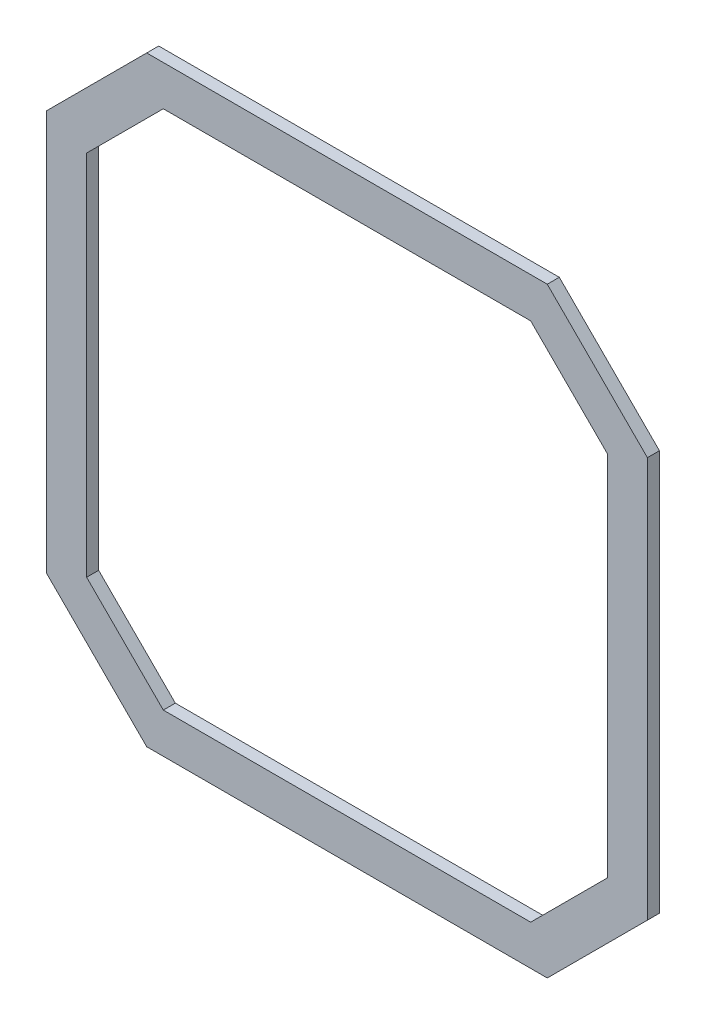
ISO-10303-21;
HEADER;
FILE_DESCRIPTION(('STEP AP214'),'2;1');
FILE_NAME('part.step','',(''),(''),'','','');
FILE_SCHEMA(('AUTOMOTIVE_DESIGN { 1 0 10303 214 1 1 1 1 }'));
ENDSEC;
DATA;
#1=APPLICATION_CONTEXT('core data for automotive mechanical design processes');
#2=APPLICATION_PROTOCOL_DEFINITION('international standard','automotive_design',2000,#1);
#3=PRODUCT_CONTEXT('',#1,'mechanical');
#4=PRODUCT('Part','Part','',(#3));
#5=PRODUCT_RELATED_PRODUCT_CATEGORY('part','',(#4));
#6=PRODUCT_DEFINITION_FORMATION('','',#4);
#7=PRODUCT_DEFINITION_CONTEXT('part definition',#1,'design');
#8=PRODUCT_DEFINITION('design','',#6,#7);
#9=PRODUCT_DEFINITION_SHAPE('','',#8);
#10=(LENGTH_UNIT() NAMED_UNIT(*) SI_UNIT(.MILLI.,.METRE.));
#11=(NAMED_UNIT(*) PLANE_ANGLE_UNIT() SI_UNIT($,.RADIAN.));
#12=(NAMED_UNIT(*) SI_UNIT($,.STERADIAN.) SOLID_ANGLE_UNIT());
#13=UNCERTAINTY_MEASURE_WITH_UNIT(LENGTH_MEASURE(1.E-05),#10,'distance_accuracy_value','');
#14=(GEOMETRIC_REPRESENTATION_CONTEXT(3) GLOBAL_UNCERTAINTY_ASSIGNED_CONTEXT((#13)) GLOBAL_UNIT_ASSIGNED_CONTEXT((#10,
#11,#12)) REPRESENTATION_CONTEXT('',''));
#15=CARTESIAN_POINT('',(0.,0.,0.));
#16=DIRECTION('',(0.,0.,1.));
#17=DIRECTION('',(1.,0.,0.));
#18=AXIS2_PLACEMENT_3D('',#15,#16,#17);
#19=CARTESIAN_POINT('',(0.,0.,3.));
#20=DIRECTION('',(0.,0.,-1.));
#21=DIRECTION('',(-1.,0.,0.));
#22=AXIS2_PLACEMENT_3D('',#19,#20,#21);
#23=PLANE('',#22);
#24=DIRECTION('',(-1.,0.,0.));
#25=VECTOR('',#24,1.);
#26=CARTESIAN_POINT('',(-54.5,78.6672862453531,3.));
#27=LINE('',#26,#25);
#28=CARTESIAN_POINT('',(45.5,78.6672862453531,3.));
#29=VERTEX_POINT('',#28);
#30=CARTESIAN_POINT('',(-54.5,78.6672862453531,3.));
#31=VERTEX_POINT('',#30);
#32=EDGE_CURVE('E212',#29,#31,#27,.T.);
#33=ORIENTED_EDGE('',*,*,#32,.T.);
#34=DIRECTION('',(-0.707106781186547,-0.707106781186548,0.));
#35=VECTOR('',#34,1.);
#36=CARTESIAN_POINT('',(-54.5,78.6672862453531,3.));
#37=LINE('',#36,#35);
#38=CARTESIAN_POINT('',(-79.5,53.6672862453531,3.));
#39=VERTEX_POINT('',#38);
#40=EDGE_CURVE('E215',#31,#39,#37,.T.);
#41=ORIENTED_EDGE('',*,*,#40,.T.);
#42=DIRECTION('',(0.,-1.,0.));
#43=VECTOR('',#42,1.);
#44=CARTESIAN_POINT('',(-79.5,53.6672862453531,3.));
#45=LINE('',#44,#43);
#46=CARTESIAN_POINT('',(-79.5,-46.332713754647,3.));
#47=VERTEX_POINT('',#46);
#48=EDGE_CURVE('E218',#39,#47,#45,.T.);
#49=ORIENTED_EDGE('',*,*,#48,.T.);
#50=DIRECTION('',(0.707106781186549,-0.707106781186546,0.));
#51=VECTOR('',#50,1.);
#52=CARTESIAN_POINT('',(-54.5,-71.3327137546469,3.));
#53=LINE('',#52,#51);
#54=CARTESIAN_POINT('',(-54.5,-71.3327137546469,3.));
#55=VERTEX_POINT('',#54);
#56=EDGE_CURVE('E220',#47,#55,#53,.T.);
#57=ORIENTED_EDGE('',*,*,#56,.T.);
#58=DIRECTION('',(1.,0.,0.));
#59=VECTOR('',#58,1.);
#60=CARTESIAN_POINT('',(-54.5,-71.3327137546469,3.));
#61=LINE('',#60,#59);
#62=CARTESIAN_POINT('',(45.5,-71.3327137546469,3.));
#63=VERTEX_POINT('',#62);
#64=EDGE_CURVE('E222',#55,#63,#61,.T.);
#65=ORIENTED_EDGE('',*,*,#64,.T.);
#66=DIRECTION('',(0.707106781186549,0.707106781186545,0.));
#67=VECTOR('',#66,1.);
#68=CARTESIAN_POINT('',(45.5,-71.3327137546469,3.));
#69=LINE('',#68,#67);
#70=CARTESIAN_POINT('',(70.5000000000001,-46.3327137546469,3.));
#71=VERTEX_POINT('',#70);
#72=EDGE_CURVE('E224',#63,#71,#69,.T.);
#73=ORIENTED_EDGE('',*,*,#72,.T.);
#74=DIRECTION('',(0.,1.,0.));
#75=VECTOR('',#74,1.);
#76=CARTESIAN_POINT('',(70.5000000000001,53.6672862453531,3.));
#77=LINE('',#76,#75);
#78=CARTESIAN_POINT('',(70.5000000000001,53.6672862453531,3.));
#79=VERTEX_POINT('',#78);
#80=EDGE_CURVE('E226',#71,#79,#77,.T.);
#81=ORIENTED_EDGE('',*,*,#80,.T.);
#82=DIRECTION('',(-0.707106781186549,0.707106781186545,0.));
#83=VECTOR('',#82,1.);
#84=CARTESIAN_POINT('',(45.5,78.6672862453531,3.));
#85=LINE('',#84,#83);
#86=EDGE_CURVE('E228',#79,#29,#85,.T.);
#87=ORIENTED_EDGE('',*,*,#86,.T.);
#88=EDGE_LOOP('',(#33,#41,#49,#57,#65,#73,#81,#87));
#89=FACE_BOUND('',#88,.T.);
#90=DIRECTION('',(-1.,0.,0.));
#91=VECTOR('',#90,1.);
#92=CARTESIAN_POINT('',(-50.3578643762691,68.6672862453531,3.));
#93=LINE('',#92,#91);
#94=CARTESIAN_POINT('',(41.357864376269,68.6672862453531,3.));
#95=VERTEX_POINT('',#94);
#96=CARTESIAN_POINT('',(-50.3578643762691,68.6672862453531,3.));
#97=VERTEX_POINT('',#96);
#98=EDGE_CURVE('E147',#95,#97,#93,.T.);
#99=ORIENTED_EDGE('',*,*,#98,.F.);
#100=DIRECTION('',(-0.70710678118655,0.707106781186545,0.));
#101=VECTOR('',#100,1.);
#102=CARTESIAN_POINT('',(41.357864376269,68.6672862453531,3.));
#103=LINE('',#102,#101);
#104=CARTESIAN_POINT('',(60.5000000000001,49.5251506216222,3.));
#105=VERTEX_POINT('',#104);
#106=EDGE_CURVE('E180',#105,#95,#103,.T.);
#107=ORIENTED_EDGE('',*,*,#106,.F.);
#108=DIRECTION('',(0.,1.,0.));
#109=VECTOR('',#108,1.);
#110=CARTESIAN_POINT('',(60.5000000000001,49.5251506216222,3.));
#111=LINE('',#110,#109);
#112=CARTESIAN_POINT('',(60.5000000000001,-42.190578130916,3.));
#113=VERTEX_POINT('',#112);
#114=EDGE_CURVE('E178',#113,#105,#111,.T.);
#115=ORIENTED_EDGE('',*,*,#114,.F.);
#116=DIRECTION('',(0.70710678118655,0.707106781186545,0.));
#117=VECTOR('',#116,1.);
#118=CARTESIAN_POINT('',(41.357864376269,-61.3327137546469,3.));
#119=LINE('',#118,#117);
#120=CARTESIAN_POINT('',(41.357864376269,-61.3327137546469,3.));
#121=VERTEX_POINT('',#120);
#122=EDGE_CURVE('E176',#121,#113,#119,.T.);
#123=ORIENTED_EDGE('',*,*,#122,.F.);
#124=DIRECTION('',(1.,0.,0.));
#125=VECTOR('',#124,1.);
#126=CARTESIAN_POINT('',(-50.3578643762691,-61.3327137546469,3.));
#127=LINE('',#126,#125);
#128=CARTESIAN_POINT('',(-50.3578643762691,-61.3327137546469,3.));
#129=VERTEX_POINT('',#128);
#130=EDGE_CURVE('E174',#129,#121,#127,.T.);
#131=ORIENTED_EDGE('',*,*,#130,.F.);
#132=DIRECTION('',(0.70710678118655,-0.707106781186545,0.));
#133=VECTOR('',#132,1.);
#134=CARTESIAN_POINT('',(-50.3578643762691,-61.3327137546469,3.));
#135=LINE('',#134,#133);
#136=CARTESIAN_POINT('',(-69.5,-42.190578130916,3.));
#137=VERTEX_POINT('',#136);
#138=EDGE_CURVE('E170',#137,#129,#135,.T.);
#139=ORIENTED_EDGE('',*,*,#138,.F.);
#140=DIRECTION('',(0.,-1.,0.));
#141=VECTOR('',#140,1.);
#142=CARTESIAN_POINT('',(-69.5,49.5251506216221,3.));
#143=LINE('',#142,#141);
#144=CARTESIAN_POINT('',(-69.5,49.5251506216221,3.));
#145=VERTEX_POINT('',#144);
#146=EDGE_CURVE('E168',#145,#137,#143,.T.);
#147=ORIENTED_EDGE('',*,*,#146,.F.);
#148=DIRECTION('',(-0.707106781186547,-0.707106781186547,0.));
#149=VECTOR('',#148,1.);
#150=CARTESIAN_POINT('',(-50.3578643762691,68.6672862453531,3.));
#151=LINE('',#150,#149);
#152=EDGE_CURVE('E155',#97,#145,#151,.T.);
#153=ORIENTED_EDGE('',*,*,#152,.F.);
#154=EDGE_LOOP('',(#99,#107,#115,#123,#131,#139,#147,#153));
#155=FACE_BOUND('',#154,.T.);
#156=ADVANCED_FACE('F34',(#89,#155),#23,.F.);
#157=CARTESIAN_POINT('',(0.,0.,0.));
#158=DIRECTION('',(0.,0.,-1.));
#159=DIRECTION('',(-1.,0.,0.));
#160=AXIS2_PLACEMENT_3D('',#157,#158,#159);
#161=PLANE('',#160);
#162=DIRECTION('',(-1.,0.,0.));
#163=VECTOR('',#162,1.);
#164=CARTESIAN_POINT('',(-54.5,78.6672862453531,0.));
#165=LINE('',#164,#163);
#166=CARTESIAN_POINT('',(45.5,78.6672862453531,0.));
#167=VERTEX_POINT('',#166);
#168=CARTESIAN_POINT('',(-54.5,78.6672862453531,0.));
#169=VERTEX_POINT('',#168);
#170=EDGE_CURVE('E163',#167,#169,#165,.T.);
#171=ORIENTED_EDGE('',*,*,#170,.F.);
#172=DIRECTION('',(-0.707106781186549,0.707106781186545,0.));
#173=VECTOR('',#172,1.);
#174=CARTESIAN_POINT('',(45.5,78.6672862453531,0.));
#175=LINE('',#174,#173);
#176=CARTESIAN_POINT('',(70.5000000000001,53.6672862453531,0.));
#177=VERTEX_POINT('',#176);
#178=EDGE_CURVE('E216',#177,#167,#175,.T.);
#179=ORIENTED_EDGE('',*,*,#178,.F.);
#180=DIRECTION('',(0.,1.,0.));
#181=VECTOR('',#180,1.);
#182=CARTESIAN_POINT('',(70.5000000000001,53.6672862453531,0.));
#183=LINE('',#182,#181);
#184=CARTESIAN_POINT('',(70.5000000000001,-46.3327137546469,0.));
#185=VERTEX_POINT('',#184);
#186=EDGE_CURVE('E243',#185,#177,#183,.T.);
#187=ORIENTED_EDGE('',*,*,#186,.F.);
#188=DIRECTION('',(0.707106781186549,0.707106781186545,0.));
#189=VECTOR('',#188,1.);
#190=CARTESIAN_POINT('',(45.5,-71.3327137546469,0.));
#191=LINE('',#190,#189);
#192=CARTESIAN_POINT('',(45.5,-71.3327137546469,0.));
#193=VERTEX_POINT('',#192);
#194=EDGE_CURVE('E241',#193,#185,#191,.T.);
#195=ORIENTED_EDGE('',*,*,#194,.F.);
#196=DIRECTION('',(1.,0.,0.));
#197=VECTOR('',#196,1.);
#198=CARTESIAN_POINT('',(-54.5,-71.3327137546469,0.));
#199=LINE('',#198,#197);
#200=CARTESIAN_POINT('',(-54.5,-71.3327137546469,0.));
#201=VERTEX_POINT('',#200);
#202=EDGE_CURVE('E239',#201,#193,#199,.T.);
#203=ORIENTED_EDGE('',*,*,#202,.F.);
#204=DIRECTION('',(0.707106781186549,-0.707106781186546,0.));
#205=VECTOR('',#204,1.);
#206=CARTESIAN_POINT('',(-54.5,-71.3327137546469,0.));
#207=LINE('',#206,#205);
#208=CARTESIAN_POINT('',(-79.5,-46.332713754647,0.));
#209=VERTEX_POINT('',#208);
#210=EDGE_CURVE('E237',#209,#201,#207,.T.);
#211=ORIENTED_EDGE('',*,*,#210,.F.);
#212=DIRECTION('',(0.,-1.,0.));
#213=VECTOR('',#212,1.);
#214=CARTESIAN_POINT('',(-79.5,53.6672862453531,0.));
#215=LINE('',#214,#213);
#216=CARTESIAN_POINT('',(-79.5,53.6672862453531,0.));
#217=VERTEX_POINT('',#216);
#218=EDGE_CURVE('E235',#217,#209,#215,.T.);
#219=ORIENTED_EDGE('',*,*,#218,.F.);
#220=DIRECTION('',(-0.707106781186547,-0.707106781186548,0.));
#221=VECTOR('',#220,1.);
#222=CARTESIAN_POINT('',(-54.5,78.6672862453531,0.));
#223=LINE('',#222,#221);
#224=EDGE_CURVE('E233',#169,#217,#223,.T.);
#225=ORIENTED_EDGE('',*,*,#224,.F.);
#226=EDGE_LOOP('',(#171,#179,#187,#195,#203,#211,#219,#225));
#227=FACE_BOUND('',#226,.T.);
#228=DIRECTION('',(-0.70710678118655,0.707106781186545,0.));
#229=VECTOR('',#228,1.);
#230=CARTESIAN_POINT('',(41.357864376269,68.6672862453531,0.));
#231=LINE('',#230,#229);
#232=CARTESIAN_POINT('',(60.5000000000001,49.5251506216222,0.));
#233=VERTEX_POINT('',#232);
#234=CARTESIAN_POINT('',(41.357864376269,68.6672862453531,0.));
#235=VERTEX_POINT('',#234);
#236=EDGE_CURVE('E156',#233,#235,#231,.T.);
#237=ORIENTED_EDGE('',*,*,#236,.T.);
#238=DIRECTION('',(-1.,0.,0.));
#239=VECTOR('',#238,1.);
#240=CARTESIAN_POINT('',(-50.3578643762691,68.6672862453531,0.));
#241=LINE('',#240,#239);
#242=CARTESIAN_POINT('',(-50.3578643762691,68.6672862453531,0.));
#243=VERTEX_POINT('',#242);
#244=EDGE_CURVE('E57',#235,#243,#241,.T.);
#245=ORIENTED_EDGE('',*,*,#244,.T.);
#246=DIRECTION('',(-0.707106781186547,-0.707106781186547,0.));
#247=VECTOR('',#246,1.);
#248=CARTESIAN_POINT('',(-50.3578643762691,68.6672862453531,0.));
#249=LINE('',#248,#247);
#250=CARTESIAN_POINT('',(-69.5,49.5251506216221,0.));
#251=VERTEX_POINT('',#250);
#252=EDGE_CURVE('E162',#243,#251,#249,.T.);
#253=ORIENTED_EDGE('',*,*,#252,.T.);
#254=DIRECTION('',(0.,-1.,0.));
#255=VECTOR('',#254,1.);
#256=CARTESIAN_POINT('',(-69.5,49.5251506216221,0.));
#257=LINE('',#256,#255);
#258=CARTESIAN_POINT('',(-69.5,-42.190578130916,0.));
#259=VERTEX_POINT('',#258);
#260=EDGE_CURVE('E184',#251,#259,#257,.T.);
#261=ORIENTED_EDGE('',*,*,#260,.T.);
#262=DIRECTION('',(0.70710678118655,-0.707106781186545,0.));
#263=VECTOR('',#262,1.);
#264=CARTESIAN_POINT('',(-50.3578643762691,-61.3327137546469,0.));
#265=LINE('',#264,#263);
#266=CARTESIAN_POINT('',(-50.3578643762691,-61.3327137546469,0.));
#267=VERTEX_POINT('',#266);
#268=EDGE_CURVE('E187',#259,#267,#265,.T.);
#269=ORIENTED_EDGE('',*,*,#268,.T.);
#270=DIRECTION('',(1.,0.,0.));
#271=VECTOR('',#270,1.);
#272=CARTESIAN_POINT('',(-50.3578643762691,-61.3327137546469,0.));
#273=LINE('',#272,#271);
#274=CARTESIAN_POINT('',(41.357864376269,-61.3327137546469,0.));
#275=VERTEX_POINT('',#274);
#276=EDGE_CURVE('E190',#267,#275,#273,.T.);
#277=ORIENTED_EDGE('',*,*,#276,.T.);
#278=DIRECTION('',(0.70710678118655,0.707106781186545,0.));
#279=VECTOR('',#278,1.);
#280=CARTESIAN_POINT('',(41.357864376269,-61.3327137546469,0.));
#281=LINE('',#280,#279);
#282=CARTESIAN_POINT('',(60.5000000000001,-42.190578130916,0.));
#283=VERTEX_POINT('',#282);
#284=EDGE_CURVE('E193',#275,#283,#281,.T.);
#285=ORIENTED_EDGE('',*,*,#284,.T.);
#286=DIRECTION('',(0.,1.,0.));
#287=VECTOR('',#286,1.);
#288=CARTESIAN_POINT('',(60.5000000000001,49.5251506216222,0.));
#289=LINE('',#288,#287);
#290=EDGE_CURVE('E196',#283,#233,#289,.T.);
#291=ORIENTED_EDGE('',*,*,#290,.T.);
#292=EDGE_LOOP('',(#237,#245,#253,#261,#269,#277,#285,#291));
#293=FACE_BOUND('',#292,.T.);
#294=ADVANCED_FACE('F273',(#227,#293),#161,.T.);
#295=CARTESIAN_POINT('',(-54.5,78.6672862453531,3.));
#296=DIRECTION('',(0.,-1.,0.));
#297=DIRECTION('',(0.,0.,-1.));
#298=AXIS2_PLACEMENT_3D('',#295,#296,#297);
#299=PLANE('',#298);
#300=ORIENTED_EDGE('',*,*,#170,.T.);
#301=DIRECTION('',(0.,0.,-1.));
#302=VECTOR('',#301,1.);
#303=CARTESIAN_POINT('',(-54.5,78.6672862453531,3.));
#304=LINE('',#303,#302);
#305=EDGE_CURVE('E11',#31,#169,#304,.T.);
#306=ORIENTED_EDGE('',*,*,#305,.F.);
#307=ORIENTED_EDGE('',*,*,#32,.F.);
#308=DIRECTION('',(0.,0.,-1.));
#309=VECTOR('',#308,1.);
#310=CARTESIAN_POINT('',(45.5,78.6672862453531,3.));
#311=LINE('',#310,#309);
#312=EDGE_CURVE('E230',#29,#167,#311,.T.);
#313=ORIENTED_EDGE('',*,*,#312,.T.);
#314=EDGE_LOOP('',(#300,#306,#307,#313));
#315=FACE_BOUND('',#314,.T.);
#316=ADVANCED_FACE('F36',(#315),#299,.F.);
#317=CARTESIAN_POINT('',(-54.5,78.6672862453531,3.));
#318=DIRECTION('',(0.707106781186548,-0.707106781186547,0.));
#319=DIRECTION('',(0.707106781186547,0.707106781186548,0.));
#320=AXIS2_PLACEMENT_3D('',#317,#318,#319);
#321=PLANE('',#320);
#322=ORIENTED_EDGE('',*,*,#224,.T.);
#323=DIRECTION('',(0.,0.,-1.));
#324=VECTOR('',#323,1.);
#325=CARTESIAN_POINT('',(-79.5,53.6672862453531,3.));
#326=LINE('',#325,#324);
#327=EDGE_CURVE('E42',#39,#217,#326,.T.);
#328=ORIENTED_EDGE('',*,*,#327,.F.);
#329=ORIENTED_EDGE('',*,*,#40,.F.);
#330=ORIENTED_EDGE('',*,*,#305,.T.);
#331=EDGE_LOOP('',(#322,#328,#329,#330));
#332=FACE_BOUND('',#331,.T.);
#333=ADVANCED_FACE('F290',(#332),#321,.F.);
#334=CARTESIAN_POINT('',(-79.5,53.6672862453531,3.));
#335=DIRECTION('',(1.,0.,0.));
#336=DIRECTION('',(0.,1.,0.));
#337=AXIS2_PLACEMENT_3D('',#334,#335,#336);
#338=PLANE('',#337);
#339=ORIENTED_EDGE('',*,*,#218,.T.);
#340=DIRECTION('',(0.,0.,-1.));
#341=VECTOR('',#340,1.);
#342=CARTESIAN_POINT('',(-79.5,-46.332713754647,3.));
#343=LINE('',#342,#341);
#344=EDGE_CURVE('E260',#47,#209,#343,.T.);
#345=ORIENTED_EDGE('',*,*,#344,.F.);
#346=ORIENTED_EDGE('',*,*,#48,.F.);
#347=ORIENTED_EDGE('',*,*,#327,.T.);
#348=EDGE_LOOP('',(#339,#345,#346,#347));
#349=FACE_BOUND('',#348,.T.);
#350=ADVANCED_FACE('F267',(#349),#338,.F.);
#351=CARTESIAN_POINT('',(-54.5,-71.3327137546469,3.));
#352=DIRECTION('',(0.707106781186546,0.707106781186549,0.));
#353=DIRECTION('',(-0.707106781186549,0.707106781186546,0.));
#354=AXIS2_PLACEMENT_3D('',#351,#352,#353);
#355=PLANE('',#354);
#356=ORIENTED_EDGE('',*,*,#210,.T.);
#357=DIRECTION('',(0.,0.,-1.));
#358=VECTOR('',#357,1.);
#359=CARTESIAN_POINT('',(-54.5,-71.3327137546469,3.));
#360=LINE('',#359,#358);
#361=EDGE_CURVE('E257',#55,#201,#360,.T.);
#362=ORIENTED_EDGE('',*,*,#361,.F.);
#363=ORIENTED_EDGE('',*,*,#56,.F.);
#364=ORIENTED_EDGE('',*,*,#344,.T.);
#365=EDGE_LOOP('',(#356,#362,#363,#364));
#366=FACE_BOUND('',#365,.T.);
#367=ADVANCED_FACE('F279',(#366),#355,.F.);
#368=CARTESIAN_POINT('',(-54.5,-71.3327137546469,3.));
#369=DIRECTION('',(0.,1.,0.));
#370=DIRECTION('',(0.,0.,1.));
#371=AXIS2_PLACEMENT_3D('',#368,#369,#370);
#372=PLANE('',#371);
#373=ORIENTED_EDGE('',*,*,#202,.T.);
#374=DIRECTION('',(0.,0.,-1.));
#375=VECTOR('',#374,1.);
#376=CARTESIAN_POINT('',(45.5,-71.3327137546469,3.));
#377=LINE('',#376,#375);
#378=EDGE_CURVE('E254',#63,#193,#377,.T.);
#379=ORIENTED_EDGE('',*,*,#378,.F.);
#380=ORIENTED_EDGE('',*,*,#64,.F.);
#381=ORIENTED_EDGE('',*,*,#361,.T.);
#382=EDGE_LOOP('',(#373,#379,#380,#381));
#383=FACE_BOUND('',#382,.T.);
#384=ADVANCED_FACE('F283',(#383),#372,.F.);
#385=CARTESIAN_POINT('',(45.5,-71.3327137546469,3.));
#386=DIRECTION('',(-0.707106781186546,0.707106781186549,0.));
#387=DIRECTION('',(-0.707106781186549,-0.707106781186546,0.));
#388=AXIS2_PLACEMENT_3D('',#385,#386,#387);
#389=PLANE('',#388);
#390=ORIENTED_EDGE('',*,*,#194,.T.);
#391=DIRECTION('',(0.,0.,-1.));
#392=VECTOR('',#391,1.);
#393=CARTESIAN_POINT('',(70.5000000000001,-46.3327137546469,3.));
#394=LINE('',#393,#392);
#395=EDGE_CURVE('E251',#71,#185,#394,.T.);
#396=ORIENTED_EDGE('',*,*,#395,.F.);
#397=ORIENTED_EDGE('',*,*,#72,.F.);
#398=ORIENTED_EDGE('',*,*,#378,.T.);
#399=EDGE_LOOP('',(#390,#396,#397,#398));
#400=FACE_BOUND('',#399,.T.);
#401=ADVANCED_FACE('F303',(#400),#389,.F.);
#402=CARTESIAN_POINT('',(70.5000000000001,53.6672862453531,3.));
#403=DIRECTION('',(-1.,0.,0.));
#404=DIRECTION('',(0.,0.,1.));
#405=AXIS2_PLACEMENT_3D('',#402,#403,#404);
#406=PLANE('',#405);
#407=ORIENTED_EDGE('',*,*,#186,.T.);
#408=DIRECTION('',(0.,0.,-1.));
#409=VECTOR('',#408,1.);
#410=CARTESIAN_POINT('',(70.5000000000001,53.6672862453531,3.));
#411=LINE('',#410,#409);
#412=EDGE_CURVE('E248',#79,#177,#411,.T.);
#413=ORIENTED_EDGE('',*,*,#412,.F.);
#414=ORIENTED_EDGE('',*,*,#80,.F.);
#415=ORIENTED_EDGE('',*,*,#395,.T.);
#416=EDGE_LOOP('',(#407,#413,#414,#415));
#417=FACE_BOUND('',#416,.T.);
#418=ADVANCED_FACE('F301',(#417),#406,.F.);
#419=CARTESIAN_POINT('',(45.5,78.6672862453531,3.));
#420=DIRECTION('',(-0.707106781186546,-0.707106781186549,0.));
#421=DIRECTION('',(0.707106781186549,-0.707106781186546,0.));
#422=AXIS2_PLACEMENT_3D('',#419,#420,#421);
#423=PLANE('',#422);
#424=ORIENTED_EDGE('',*,*,#178,.T.);
#425=ORIENTED_EDGE('',*,*,#312,.F.);
#426=ORIENTED_EDGE('',*,*,#86,.F.);
#427=ORIENTED_EDGE('',*,*,#412,.T.);
#428=EDGE_LOOP('',(#424,#425,#426,#427));
#429=FACE_BOUND('',#428,.T.);
#430=ADVANCED_FACE('F296',(#429),#423,.F.);
#431=CARTESIAN_POINT('',(-50.3578643762691,68.6672862453531,3.));
#432=DIRECTION('',(0.,-1.,0.));
#433=DIRECTION('',(0.,0.,-1.));
#434=AXIS2_PLACEMENT_3D('',#431,#432,#433);
#435=PLANE('',#434);
#436=ORIENTED_EDGE('',*,*,#244,.F.);
#437=DIRECTION('',(0.,0.,-1.));
#438=VECTOR('',#437,1.);
#439=CARTESIAN_POINT('',(41.357864376269,68.6672862453531,3.));
#440=LINE('',#439,#438);
#441=EDGE_CURVE('E151',#95,#235,#440,.T.);
#442=ORIENTED_EDGE('',*,*,#441,.F.);
#443=ORIENTED_EDGE('',*,*,#98,.T.);
#444=DIRECTION('',(0.,0.,-1.));
#445=VECTOR('',#444,1.);
#446=CARTESIAN_POINT('',(-50.3578643762691,68.6672862453531,3.));
#447=LINE('',#446,#445);
#448=EDGE_CURVE('E150',#97,#243,#447,.T.);
#449=ORIENTED_EDGE('',*,*,#448,.T.);
#450=EDGE_LOOP('',(#436,#442,#443,#449));
#451=FACE_BOUND('',#450,.T.);
#452=ADVANCED_FACE('F149',(#451),#435,.T.);
#453=CARTESIAN_POINT('',(-50.3578643762691,68.6672862453531,3.));
#454=DIRECTION('',(0.707106781186548,-0.707106781186548,0.));
#455=DIRECTION('',(0.707106781186548,0.707106781186548,0.));
#456=AXIS2_PLACEMENT_3D('',#453,#454,#455);
#457=PLANE('',#456);
#458=ORIENTED_EDGE('',*,*,#252,.F.);
#459=ORIENTED_EDGE('',*,*,#448,.F.);
#460=ORIENTED_EDGE('',*,*,#152,.T.);
#461=DIRECTION('',(0.,0.,-1.));
#462=VECTOR('',#461,1.);
#463=CARTESIAN_POINT('',(-69.5,49.5251506216221,3.));
#464=LINE('',#463,#462);
#465=EDGE_CURVE('E164',#145,#251,#464,.T.);
#466=ORIENTED_EDGE('',*,*,#465,.T.);
#467=EDGE_LOOP('',(#458,#459,#460,#466));
#468=FACE_BOUND('',#467,.T.);
#469=ADVANCED_FACE('F159',(#468),#457,.T.);
#470=CARTESIAN_POINT('',(-69.5,49.5251506216221,3.));
#471=DIRECTION('',(1.,0.,0.));
#472=DIRECTION('',(0.,1.,0.));
#473=AXIS2_PLACEMENT_3D('',#470,#471,#472);
#474=PLANE('',#473);
#475=ORIENTED_EDGE('',*,*,#260,.F.);
#476=ORIENTED_EDGE('',*,*,#465,.F.);
#477=ORIENTED_EDGE('',*,*,#146,.T.);
#478=DIRECTION('',(0.,0.,-1.));
#479=VECTOR('',#478,1.);
#480=CARTESIAN_POINT('',(-69.5,-42.190578130916,3.));
#481=LINE('',#480,#479);
#482=EDGE_CURVE('E209',#137,#259,#481,.T.);
#483=ORIENTED_EDGE('',*,*,#482,.T.);
#484=EDGE_LOOP('',(#475,#476,#477,#483));
#485=FACE_BOUND('',#484,.T.);
#486=ADVANCED_FACE('F328',(#485),#474,.T.);
#487=CARTESIAN_POINT('',(-50.3578643762691,-61.3327137546469,3.));
#488=DIRECTION('',(0.707106781186545,0.707106781186549,0.));
#489=DIRECTION('',(-0.70710678118655,0.707106781186545,0.));
#490=AXIS2_PLACEMENT_3D('',#487,#488,#489);
#491=PLANE('',#490);
#492=ORIENTED_EDGE('',*,*,#268,.F.);
#493=ORIENTED_EDGE('',*,*,#482,.F.);
#494=ORIENTED_EDGE('',*,*,#138,.T.);
#495=DIRECTION('',(0.,0.,-1.));
#496=VECTOR('',#495,1.);
#497=CARTESIAN_POINT('',(-50.3578643762691,-61.3327137546469,3.));
#498=LINE('',#497,#496);
#499=EDGE_CURVE('E207',#129,#267,#498,.T.);
#500=ORIENTED_EDGE('',*,*,#499,.T.);
#501=EDGE_LOOP('',(#492,#493,#494,#500));
#502=FACE_BOUND('',#501,.T.);
#503=ADVANCED_FACE('F332',(#502),#491,.T.);
#504=CARTESIAN_POINT('',(-50.3578643762691,-61.3327137546469,3.));
#505=DIRECTION('',(0.,1.,0.));
#506=DIRECTION('',(0.,0.,1.));
#507=AXIS2_PLACEMENT_3D('',#504,#505,#506);
#508=PLANE('',#507);
#509=ORIENTED_EDGE('',*,*,#276,.F.);
#510=ORIENTED_EDGE('',*,*,#499,.F.);
#511=ORIENTED_EDGE('',*,*,#130,.T.);
#512=DIRECTION('',(0.,0.,-1.));
#513=VECTOR('',#512,1.);
#514=CARTESIAN_POINT('',(41.357864376269,-61.3327137546469,3.));
#515=LINE('',#514,#513);
#516=EDGE_CURVE('E205',#121,#275,#515,.T.);
#517=ORIENTED_EDGE('',*,*,#516,.T.);
#518=EDGE_LOOP('',(#509,#510,#511,#517));
#519=FACE_BOUND('',#518,.T.);
#520=ADVANCED_FACE('F338',(#519),#508,.T.);
#521=CARTESIAN_POINT('',(41.357864376269,-61.3327137546469,3.));
#522=DIRECTION('',(-0.707106781186545,0.70710678118655,0.));
#523=DIRECTION('',(-0.70710678118655,-0.707106781186545,0.));
#524=AXIS2_PLACEMENT_3D('',#521,#522,#523);
#525=PLANE('',#524);
#526=ORIENTED_EDGE('',*,*,#284,.F.);
#527=ORIENTED_EDGE('',*,*,#516,.F.);
#528=ORIENTED_EDGE('',*,*,#122,.T.);
#529=DIRECTION('',(0.,0.,-1.));
#530=VECTOR('',#529,1.);
#531=CARTESIAN_POINT('',(60.5000000000001,-42.190578130916,3.));
#532=LINE('',#531,#530);
#533=EDGE_CURVE('E203',#113,#283,#532,.T.);
#534=ORIENTED_EDGE('',*,*,#533,.T.);
#535=EDGE_LOOP('',(#526,#527,#528,#534));
#536=FACE_BOUND('',#535,.T.);
#537=ADVANCED_FACE('F342',(#536),#525,.T.);
#538=CARTESIAN_POINT('',(60.5000000000001,49.5251506216222,3.));
#539=DIRECTION('',(-1.,0.,0.));
#540=DIRECTION('',(0.,-1.,0.));
#541=AXIS2_PLACEMENT_3D('',#538,#539,#540);
#542=PLANE('',#541);
#543=ORIENTED_EDGE('',*,*,#290,.F.);
#544=ORIENTED_EDGE('',*,*,#533,.F.);
#545=ORIENTED_EDGE('',*,*,#114,.T.);
#546=DIRECTION('',(0.,0.,-1.));
#547=VECTOR('',#546,1.);
#548=CARTESIAN_POINT('',(60.5000000000001,49.5251506216222,3.));
#549=LINE('',#548,#547);
#550=EDGE_CURVE('E49',#105,#233,#549,.T.);
#551=ORIENTED_EDGE('',*,*,#550,.T.);
#552=EDGE_LOOP('',(#543,#544,#545,#551));
#553=FACE_BOUND('',#552,.T.);
#554=ADVANCED_FACE('F346',(#553),#542,.T.);
#555=CARTESIAN_POINT('',(41.357864376269,68.6672862453531,3.));
#556=DIRECTION('',(-0.707106781186545,-0.707106781186549,0.));
#557=DIRECTION('',(0.70710678118655,-0.707106781186545,0.));
#558=AXIS2_PLACEMENT_3D('',#555,#556,#557);
#559=PLANE('',#558);
#560=ORIENTED_EDGE('',*,*,#236,.F.);
#561=ORIENTED_EDGE('',*,*,#550,.F.);
#562=ORIENTED_EDGE('',*,*,#106,.T.);
#563=ORIENTED_EDGE('',*,*,#441,.T.);
#564=EDGE_LOOP('',(#560,#561,#562,#563));
#565=FACE_BOUND('',#564,.T.);
#566=ADVANCED_FACE('F350',(#565),#559,.T.);
#567=CLOSED_SHELL('',(#156,#294,#316,#333,#350,#367,#384,#401,#418,#430,#452,#469,#486,#503,
#520,#537,#554,#566));
#568=MANIFOLD_SOLID_BREP('B2',#567);
#569=ADVANCED_BREP_SHAPE_REPRESENTATION('',(#18,#568),#14);
#570=SHAPE_DEFINITION_REPRESENTATION(#9,#569);
ENDSEC;
END-ISO-10303-21;
